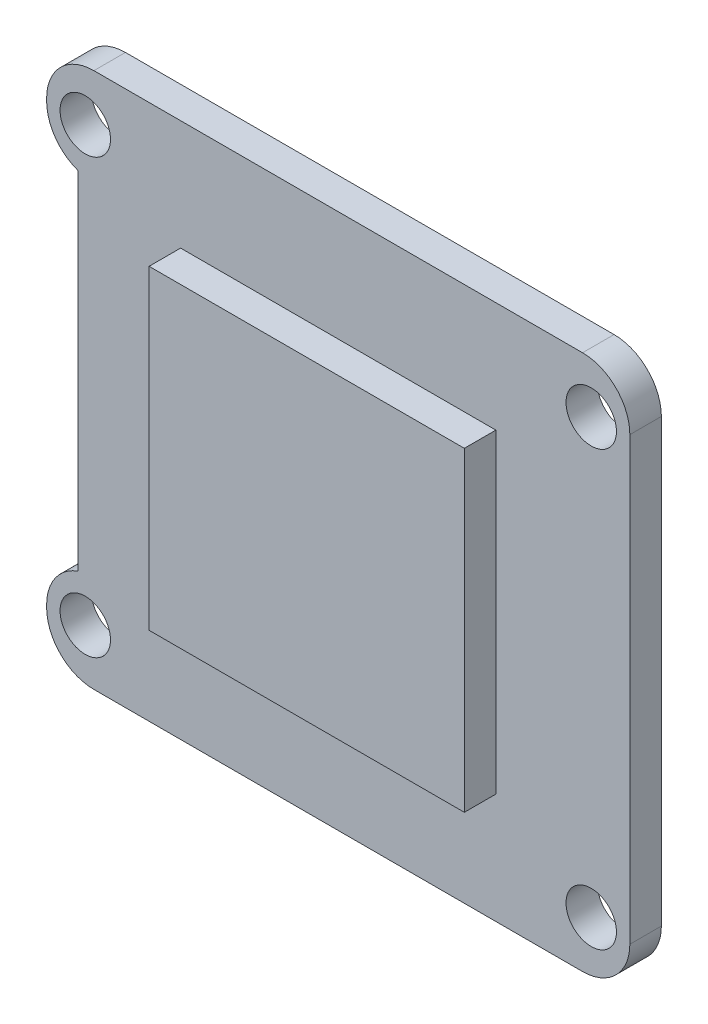
ISO-10303-21;
HEADER;
FILE_DESCRIPTION(('STEP AP214'),'2;1');
FILE_NAME('part.step','',(''),(''),'','','');
FILE_SCHEMA(('AUTOMOTIVE_DESIGN { 1 0 10303 214 1 1 1 1 }'));
ENDSEC;
DATA;
#1=APPLICATION_CONTEXT('core data for automotive mechanical design processes');
#2=APPLICATION_PROTOCOL_DEFINITION('international standard','automotive_design',2000,#1);
#3=PRODUCT_CONTEXT('',#1,'mechanical');
#4=PRODUCT('Part','Part','',(#3));
#5=PRODUCT_RELATED_PRODUCT_CATEGORY('part','',(#4));
#6=PRODUCT_DEFINITION_FORMATION('','',#4);
#7=PRODUCT_DEFINITION_CONTEXT('part definition',#1,'design');
#8=PRODUCT_DEFINITION('design','',#6,#7);
#9=PRODUCT_DEFINITION_SHAPE('','',#8);
#10=(LENGTH_UNIT() NAMED_UNIT(*) SI_UNIT(.MILLI.,.METRE.));
#11=(NAMED_UNIT(*) PLANE_ANGLE_UNIT() SI_UNIT($,.RADIAN.));
#12=(NAMED_UNIT(*) SI_UNIT($,.STERADIAN.) SOLID_ANGLE_UNIT());
#13=UNCERTAINTY_MEASURE_WITH_UNIT(LENGTH_MEASURE(1.E-05),#10,'distance_accuracy_value','');
#14=(GEOMETRIC_REPRESENTATION_CONTEXT(3) GLOBAL_UNCERTAINTY_ASSIGNED_CONTEXT((#13)) GLOBAL_UNIT_ASSIGNED_CONTEXT((#10,
#11,#12)) REPRESENTATION_CONTEXT('',''));
#15=CARTESIAN_POINT('',(0.,0.,0.));
#16=DIRECTION('',(0.,0.,1.));
#17=DIRECTION('',(1.,0.,0.));
#18=AXIS2_PLACEMENT_3D('',#15,#16,#17);
#19=CARTESIAN_POINT('',(0.,0.,2.));
#20=DIRECTION('',(1.,0.,0.));
#21=DIRECTION('',(0.,0.,-1.));
#22=AXIS2_PLACEMENT_3D('',#19,#20,#21);
#23=PLANE('',#22);
#24=DIRECTION('',(0.,-1.,0.));
#25=VECTOR('',#24,1.);
#26=CARTESIAN_POINT('',(0.,0.,0.));
#27=LINE('',#26,#25);
#28=CARTESIAN_POINT('',(0.,3.17157287525381,0.));
#29=VERTEX_POINT('',#28);
#30=CARTESIAN_POINT('',(0.,3.,0.));
#31=VERTEX_POINT('',#30);
#32=EDGE_CURVE('E228',#29,#31,#27,.T.);
#33=ORIENTED_EDGE('',*,*,#32,.T.);
#34=DIRECTION('',(0.,0.,-1.));
#35=VECTOR('',#34,1.);
#36=CARTESIAN_POINT('',(0.,3.,2.));
#37=LINE('',#36,#35);
#38=CARTESIAN_POINT('',(0.,3.,2.));
#39=VERTEX_POINT('',#38);
#40=EDGE_CURVE('E291',#31,#39,#37,.F.);
#41=ORIENTED_EDGE('',*,*,#40,.T.);
#42=DIRECTION('',(0.,-1.,0.));
#43=VECTOR('',#42,1.);
#44=CARTESIAN_POINT('',(0.,0.,2.));
#45=LINE('',#44,#43);
#46=CARTESIAN_POINT('',(0.,3.17157287525381,2.));
#47=VERTEX_POINT('',#46);
#48=EDGE_CURVE('E234',#47,#39,#45,.T.);
#49=ORIENTED_EDGE('',*,*,#48,.F.);
#50=DIRECTION('',(0.,0.,1.));
#51=VECTOR('',#50,1.);
#52=CARTESIAN_POINT('',(0.,3.17157287525381,2.));
#53=LINE('',#52,#51);
#54=EDGE_CURVE('E288',#47,#29,#53,.F.);
#55=ORIENTED_EDGE('',*,*,#54,.T.);
#56=EDGE_LOOP('',(#33,#41,#49,#55));
#57=FACE_BOUND('',#56,.T.);
#58=ADVANCED_FACE('F32',(#57),#23,.F.);
#59=CARTESIAN_POINT('',(0.,0.,2.));
#60=DIRECTION('',(0.,0.,-1.));
#61=DIRECTION('',(-1.,0.,0.));
#62=AXIS2_PLACEMENT_3D('',#59,#60,#61);
#63=PLANE('',#62);
#64=DIRECTION('',(0.,1.,0.));
#65=VECTOR('',#64,1.);
#66=CARTESIAN_POINT('',(37.,0.,2.));
#67=LINE('',#66,#65);
#68=CARTESIAN_POINT('',(37.,3.,2.));
#69=VERTEX_POINT('',#68);
#70=CARTESIAN_POINT('',(37.,31.,2.));
#71=VERTEX_POINT('',#70);
#72=EDGE_CURVE('E237',#69,#71,#67,.T.);
#73=ORIENTED_EDGE('',*,*,#72,.T.);
#74=CARTESIAN_POINT('',(34.,31.,2.));
#75=DIRECTION('',(0.,0.,-1.));
#76=DIRECTION('',(-1.,0.,0.));
#77=AXIS2_PLACEMENT_3D('',#74,#75,#76);
#78=CIRCLE('',#77,3.);
#79=CARTESIAN_POINT('',(34.,34.,2.));
#80=VERTEX_POINT('',#79);
#81=EDGE_CURVE('E281',#71,#80,#78,.F.);
#82=ORIENTED_EDGE('',*,*,#81,.T.);
#83=DIRECTION('',(-1.,0.,0.));
#84=VECTOR('',#83,1.);
#85=CARTESIAN_POINT('',(0.,34.,2.));
#86=LINE('',#85,#84);
#87=CARTESIAN_POINT('',(3.,34.,2.));
#88=VERTEX_POINT('',#87);
#89=EDGE_CURVE('E240',#80,#88,#86,.T.);
#90=ORIENTED_EDGE('',*,*,#89,.T.);
#91=CARTESIAN_POINT('',(3.,31.,2.));
#92=DIRECTION('',(0.,0.,-1.));
#93=DIRECTION('',(-1.,0.,0.));
#94=AXIS2_PLACEMENT_3D('',#91,#92,#93);
#95=CIRCLE('',#94,3.);
#96=CARTESIAN_POINT('',(0.,31.,2.));
#97=VERTEX_POINT('',#96);
#98=EDGE_CURVE('E52',#88,#97,#95,.F.);
#99=ORIENTED_EDGE('',*,*,#98,.T.);
#100=CARTESIAN_POINT('',(0.,30.8284271247462,2.));
#101=VERTEX_POINT('',#100);
#102=EDGE_CURVE('E231',#97,#101,#45,.T.);
#103=ORIENTED_EDGE('',*,*,#102,.T.);
#104=CARTESIAN_POINT('',(3.,30.8284271247462,2.));
#105=DIRECTION('',(0.,0.,-1.));
#106=DIRECTION('',(-1.,0.,0.));
#107=AXIS2_PLACEMENT_3D('',#104,#105,#106);
#108=CIRCLE('',#107,3.);
#109=CARTESIAN_POINT('',(2.,28.,2.));
#110=VERTEX_POINT('',#109);
#111=EDGE_CURVE('E273',#101,#110,#108,.F.);
#112=ORIENTED_EDGE('',*,*,#111,.T.);
#113=DIRECTION('',(0.,-1.,0.));
#114=VECTOR('',#113,1.);
#115=CARTESIAN_POINT('',(2.,0.,2.));
#116=LINE('',#115,#114);
#117=CARTESIAN_POINT('',(2.,6.,2.));
#118=VERTEX_POINT('',#117);
#119=EDGE_CURVE('E162',#110,#118,#116,.T.);
#120=ORIENTED_EDGE('',*,*,#119,.T.);
#121=CARTESIAN_POINT('',(3.,3.17157287525381,2.));
#122=DIRECTION('',(0.,0.,-1.));
#123=DIRECTION('',(-1.,0.,0.));
#124=AXIS2_PLACEMENT_3D('',#121,#122,#123);
#125=CIRCLE('',#124,3.);
#126=EDGE_CURVE('E275',#118,#47,#125,.F.);
#127=ORIENTED_EDGE('',*,*,#126,.T.);
#128=ORIENTED_EDGE('',*,*,#48,.T.);
#129=CARTESIAN_POINT('',(3.,3.,2.));
#130=DIRECTION('',(0.,0.,-1.));
#131=DIRECTION('',(-1.,0.,0.));
#132=AXIS2_PLACEMENT_3D('',#129,#130,#131);
#133=CIRCLE('',#132,3.);
#134=CARTESIAN_POINT('',(3.,0.,2.));
#135=VERTEX_POINT('',#134);
#136=EDGE_CURVE('E277',#39,#135,#133,.F.);
#137=ORIENTED_EDGE('',*,*,#136,.T.);
#138=DIRECTION('',(1.,0.,0.));
#139=VECTOR('',#138,1.);
#140=CARTESIAN_POINT('',(0.,0.,2.));
#141=LINE('',#140,#139);
#142=CARTESIAN_POINT('',(34.,0.,2.));
#143=VERTEX_POINT('',#142);
#144=EDGE_CURVE('E233',#135,#143,#141,.T.);
#145=ORIENTED_EDGE('',*,*,#144,.T.);
#146=CARTESIAN_POINT('',(34.,3.,2.));
#147=DIRECTION('',(0.,0.,-1.));
#148=DIRECTION('',(-1.,0.,0.));
#149=AXIS2_PLACEMENT_3D('',#146,#147,#148);
#150=CIRCLE('',#149,3.);
#151=EDGE_CURVE('E279',#143,#69,#150,.F.);
#152=ORIENTED_EDGE('',*,*,#151,.T.);
#153=EDGE_LOOP('',(#73,#82,#90,#99,#103,#112,#120,#127,#128,#137,#145,#152));
#154=FACE_BOUND('',#153,.T.);
#155=CARTESIAN_POINT('',(34.55,30.75,2.));
#156=DIRECTION('',(0.,0.,1.));
#157=DIRECTION('',(1.,0.,0.));
#158=AXIS2_PLACEMENT_3D('',#155,#156,#157);
#159=CIRCLE('',#158,1.6);
#160=CARTESIAN_POINT('',(36.15,30.75,2.));
#161=VERTEX_POINT('',#160);
#162=EDGE_CURVE('E216',#161,#161,#159,.T.);
#163=ORIENTED_EDGE('',*,*,#162,.F.);
#164=EDGE_LOOP('',(#163));
#165=FACE_BOUND('',#164,.T.);
#166=CARTESIAN_POINT('',(2.45,3.25000000000001,2.));
#167=DIRECTION('',(0.,0.,1.));
#168=DIRECTION('',(1.,0.,0.));
#169=AXIS2_PLACEMENT_3D('',#166,#167,#168);
#170=CIRCLE('',#169,1.6);
#171=CARTESIAN_POINT('',(4.05,3.25000000000001,2.));
#172=VERTEX_POINT('',#171);
#173=EDGE_CURVE('E207',#172,#172,#170,.T.);
#174=ORIENTED_EDGE('',*,*,#173,.F.);
#175=EDGE_LOOP('',(#174));
#176=FACE_BOUND('',#175,.T.);
#177=CARTESIAN_POINT('',(2.45,30.75,2.));
#178=DIRECTION('',(0.,0.,1.));
#179=DIRECTION('',(1.,0.,0.));
#180=AXIS2_PLACEMENT_3D('',#177,#178,#179);
#181=CIRCLE('',#180,1.6);
#182=CARTESIAN_POINT('',(4.05,30.75,2.));
#183=VERTEX_POINT('',#182);
#184=EDGE_CURVE('E220',#183,#183,#181,.T.);
#185=ORIENTED_EDGE('',*,*,#184,.F.);
#186=EDGE_LOOP('',(#185));
#187=FACE_BOUND('',#186,.T.);
#188=CARTESIAN_POINT('',(34.55,3.25000000000001,2.));
#189=DIRECTION('',(0.,0.,1.));
#190=DIRECTION('',(1.,0.,0.));
#191=AXIS2_PLACEMENT_3D('',#188,#189,#190);
#192=CIRCLE('',#191,1.6);
#193=CARTESIAN_POINT('',(36.15,3.25000000000001,2.));
#194=VERTEX_POINT('',#193);
#195=EDGE_CURVE('E213',#194,#194,#192,.T.);
#196=ORIENTED_EDGE('',*,*,#195,.F.);
#197=EDGE_LOOP('',(#196));
#198=FACE_BOUND('',#197,.T.);
#199=DIRECTION('',(0.,1.,0.));
#200=VECTOR('',#199,1.);
#201=CARTESIAN_POINT('',(28.5,7.00000000000001,2.));
#202=LINE('',#201,#200);
#203=CARTESIAN_POINT('',(28.5,7.00000000000001,2.));
#204=VERTEX_POINT('',#203);
#205=CARTESIAN_POINT('',(28.5,27.,2.));
#206=VERTEX_POINT('',#205);
#207=EDGE_CURVE('E173',#204,#206,#202,.T.);
#208=ORIENTED_EDGE('',*,*,#207,.F.);
#209=DIRECTION('',(1.,0.,0.));
#210=VECTOR('',#209,1.);
#211=CARTESIAN_POINT('',(8.5,7.00000000000001,2.));
#212=LINE('',#211,#210);
#213=CARTESIAN_POINT('',(8.5,7.00000000000001,2.));
#214=VERTEX_POINT('',#213);
#215=EDGE_CURVE('E178',#214,#204,#212,.T.);
#216=ORIENTED_EDGE('',*,*,#215,.F.);
#217=DIRECTION('',(0.,-1.,0.));
#218=VECTOR('',#217,1.);
#219=CARTESIAN_POINT('',(8.5,7.00000000000001,2.));
#220=LINE('',#219,#218);
#221=CARTESIAN_POINT('',(8.5,27.,2.));
#222=VERTEX_POINT('',#221);
#223=EDGE_CURVE('E190',#222,#214,#220,.T.);
#224=ORIENTED_EDGE('',*,*,#223,.F.);
#225=DIRECTION('',(-1.,0.,0.));
#226=VECTOR('',#225,1.);
#227=CARTESIAN_POINT('',(8.5,27.,2.));
#228=LINE('',#227,#226);
#229=EDGE_CURVE('E187',#206,#222,#228,.T.);
#230=ORIENTED_EDGE('',*,*,#229,.F.);
#231=EDGE_LOOP('',(#208,#216,#224,#230));
#232=FACE_BOUND('',#231,.T.);
#233=ADVANCED_FACE('F307',(#154,#165,#176,#187,#198,#232),#63,.F.);
#234=CARTESIAN_POINT('',(0.,31.,0.));
#235=VERTEX_POINT('',#234);
#236=CARTESIAN_POINT('',(0.,30.8284271247462,0.));
#237=VERTEX_POINT('',#236);
#238=EDGE_CURVE('E245',#235,#237,#27,.T.);
#239=ORIENTED_EDGE('',*,*,#238,.T.);
#240=DIRECTION('',(0.,0.,-1.));
#241=VECTOR('',#240,1.);
#242=CARTESIAN_POINT('',(0.,30.8284271247462,2.));
#243=LINE('',#242,#241);
#244=EDGE_CURVE('E11',#237,#101,#243,.F.);
#245=ORIENTED_EDGE('',*,*,#244,.T.);
#246=ORIENTED_EDGE('',*,*,#102,.F.);
#247=DIRECTION('',(0.,0.,-1.));
#248=VECTOR('',#247,1.);
#249=CARTESIAN_POINT('',(0.,31.,2.));
#250=LINE('',#249,#248);
#251=EDGE_CURVE('E40',#97,#235,#250,.T.);
#252=ORIENTED_EDGE('',*,*,#251,.T.);
#253=EDGE_LOOP('',(#239,#245,#246,#252));
#254=FACE_BOUND('',#253,.T.);
#255=ADVANCED_FACE('F294',(#254),#23,.F.);
#256=CARTESIAN_POINT('',(0.,0.,2.));
#257=DIRECTION('',(0.,1.,0.));
#258=DIRECTION('',(0.,0.,1.));
#259=AXIS2_PLACEMENT_3D('',#256,#257,#258);
#260=PLANE('',#259);
#261=DIRECTION('',(1.,0.,0.));
#262=VECTOR('',#261,1.);
#263=CARTESIAN_POINT('',(0.,0.,0.));
#264=LINE('',#263,#262);
#265=CARTESIAN_POINT('',(3.,0.,0.));
#266=VERTEX_POINT('',#265);
#267=CARTESIAN_POINT('',(34.,0.,0.));
#268=VERTEX_POINT('',#267);
#269=EDGE_CURVE('E246',#266,#268,#264,.T.);
#270=ORIENTED_EDGE('',*,*,#269,.T.);
#271=DIRECTION('',(0.,0.,-1.));
#272=VECTOR('',#271,1.);
#273=CARTESIAN_POINT('',(34.,0.,2.));
#274=LINE('',#273,#272);
#275=EDGE_CURVE('E286',#268,#143,#274,.F.);
#276=ORIENTED_EDGE('',*,*,#275,.T.);
#277=ORIENTED_EDGE('',*,*,#144,.F.);
#278=DIRECTION('',(0.,0.,-1.));
#279=VECTOR('',#278,1.);
#280=CARTESIAN_POINT('',(3.,0.,2.));
#281=LINE('',#280,#279);
#282=EDGE_CURVE('E283',#135,#266,#281,.T.);
#283=ORIENTED_EDGE('',*,*,#282,.T.);
#284=EDGE_LOOP('',(#270,#276,#277,#283));
#285=FACE_BOUND('',#284,.T.);
#286=ADVANCED_FACE('F317',(#285),#260,.F.);
#287=CARTESIAN_POINT('',(37.,0.,2.));
#288=DIRECTION('',(-1.,0.,0.));
#289=DIRECTION('',(0.,0.,1.));
#290=AXIS2_PLACEMENT_3D('',#287,#288,#289);
#291=PLANE('',#290);
#292=DIRECTION('',(0.,1.,0.));
#293=VECTOR('',#292,1.);
#294=CARTESIAN_POINT('',(37.,0.,0.));
#295=LINE('',#294,#293);
#296=CARTESIAN_POINT('',(37.,3.,0.));
#297=VERTEX_POINT('',#296);
#298=CARTESIAN_POINT('',(37.,31.,0.));
#299=VERTEX_POINT('',#298);
#300=EDGE_CURVE('E249',#297,#299,#295,.T.);
#301=ORIENTED_EDGE('',*,*,#300,.T.);
#302=DIRECTION('',(0.,0.,-1.));
#303=VECTOR('',#302,1.);
#304=CARTESIAN_POINT('',(37.,31.,2.));
#305=LINE('',#304,#303);
#306=EDGE_CURVE('E270',#299,#71,#305,.F.);
#307=ORIENTED_EDGE('',*,*,#306,.T.);
#308=ORIENTED_EDGE('',*,*,#72,.F.);
#309=DIRECTION('',(0.,0.,-1.));
#310=VECTOR('',#309,1.);
#311=CARTESIAN_POINT('',(37.,3.,2.));
#312=LINE('',#311,#310);
#313=EDGE_CURVE('E267',#69,#297,#312,.T.);
#314=ORIENTED_EDGE('',*,*,#313,.T.);
#315=EDGE_LOOP('',(#301,#307,#308,#314));
#316=FACE_BOUND('',#315,.T.);
#317=ADVANCED_FACE('F321',(#316),#291,.F.);
#318=CARTESIAN_POINT('',(0.,34.,2.));
#319=DIRECTION('',(0.,-1.,0.));
#320=DIRECTION('',(0.,0.,-1.));
#321=AXIS2_PLACEMENT_3D('',#318,#319,#320);
#322=PLANE('',#321);
#323=ORIENTED_EDGE('',*,*,#89,.F.);
#324=DIRECTION('',(0.,0.,-1.));
#325=VECTOR('',#324,1.);
#326=CARTESIAN_POINT('',(34.,34.,2.));
#327=LINE('',#326,#325);
#328=CARTESIAN_POINT('',(34.,34.,0.));
#329=VERTEX_POINT('',#328);
#330=EDGE_CURVE('E256',#80,#329,#327,.T.);
#331=ORIENTED_EDGE('',*,*,#330,.T.);
#332=DIRECTION('',(-1.,0.,0.));
#333=VECTOR('',#332,1.);
#334=CARTESIAN_POINT('',(0.,34.,0.));
#335=LINE('',#334,#333);
#336=CARTESIAN_POINT('',(3.,34.,0.));
#337=VERTEX_POINT('',#336);
#338=EDGE_CURVE('E252',#329,#337,#335,.T.);
#339=ORIENTED_EDGE('',*,*,#338,.T.);
#340=DIRECTION('',(0.,0.,-1.));
#341=VECTOR('',#340,1.);
#342=CARTESIAN_POINT('',(3.,34.,2.));
#343=LINE('',#342,#341);
#344=EDGE_CURVE('E242',#337,#88,#343,.F.);
#345=ORIENTED_EDGE('',*,*,#344,.T.);
#346=EDGE_LOOP('',(#323,#331,#339,#345));
#347=FACE_BOUND('',#346,.T.);
#348=ADVANCED_FACE('F299',(#347),#322,.F.);
#349=CARTESIAN_POINT('',(0.,0.,0.));
#350=DIRECTION('',(0.,0.,-1.));
#351=DIRECTION('',(-1.,0.,0.));
#352=AXIS2_PLACEMENT_3D('',#349,#350,#351);
#353=PLANE('',#352);
#354=ORIENTED_EDGE('',*,*,#338,.F.);
#355=CARTESIAN_POINT('',(34.,31.,0.));
#356=DIRECTION('',(0.,0.,-1.));
#357=DIRECTION('',(-1.,0.,0.));
#358=AXIS2_PLACEMENT_3D('',#355,#356,#357);
#359=CIRCLE('',#358,3.);
#360=EDGE_CURVE('E265',#329,#299,#359,.T.);
#361=ORIENTED_EDGE('',*,*,#360,.T.);
#362=ORIENTED_EDGE('',*,*,#300,.F.);
#363=CARTESIAN_POINT('',(34.,3.,0.));
#364=DIRECTION('',(0.,0.,-1.));
#365=DIRECTION('',(-1.,0.,0.));
#366=AXIS2_PLACEMENT_3D('',#363,#364,#365);
#367=CIRCLE('',#366,3.);
#368=EDGE_CURVE('E263',#297,#268,#367,.T.);
#369=ORIENTED_EDGE('',*,*,#368,.T.);
#370=ORIENTED_EDGE('',*,*,#269,.F.);
#371=CARTESIAN_POINT('',(3.,3.,0.));
#372=DIRECTION('',(0.,0.,-1.));
#373=DIRECTION('',(-1.,0.,0.));
#374=AXIS2_PLACEMENT_3D('',#371,#372,#373);
#375=CIRCLE('',#374,3.);
#376=EDGE_CURVE('E261',#266,#31,#375,.T.);
#377=ORIENTED_EDGE('',*,*,#376,.T.);
#378=ORIENTED_EDGE('',*,*,#32,.F.);
#379=CARTESIAN_POINT('',(3.,3.17157287525381,0.));
#380=DIRECTION('',(0.,0.,-1.));
#381=DIRECTION('',(-1.,0.,0.));
#382=AXIS2_PLACEMENT_3D('',#379,#380,#381);
#383=CIRCLE('',#382,3.);
#384=CARTESIAN_POINT('',(2.,6.,0.));
#385=VERTEX_POINT('',#384);
#386=EDGE_CURVE('E152',#29,#385,#383,.T.);
#387=ORIENTED_EDGE('',*,*,#386,.T.);
#388=DIRECTION('',(0.,-1.,0.));
#389=VECTOR('',#388,1.);
#390=CARTESIAN_POINT('',(2.,28.,0.));
#391=LINE('',#390,#389);
#392=CARTESIAN_POINT('',(2.,28.,0.));
#393=VERTEX_POINT('',#392);
#394=EDGE_CURVE('E159',#393,#385,#391,.T.);
#395=ORIENTED_EDGE('',*,*,#394,.F.);
#396=CARTESIAN_POINT('',(3.,30.8284271247462,0.));
#397=DIRECTION('',(0.,0.,-1.));
#398=DIRECTION('',(-1.,0.,0.));
#399=AXIS2_PLACEMENT_3D('',#396,#397,#398);
#400=CIRCLE('',#399,3.);
#401=EDGE_CURVE('E144',#393,#237,#400,.T.);
#402=ORIENTED_EDGE('',*,*,#401,.T.);
#403=ORIENTED_EDGE('',*,*,#238,.F.);
#404=CARTESIAN_POINT('',(3.,31.,0.));
#405=DIRECTION('',(0.,0.,-1.));
#406=DIRECTION('',(-1.,0.,0.));
#407=AXIS2_PLACEMENT_3D('',#404,#405,#406);
#408=CIRCLE('',#407,3.);
#409=EDGE_CURVE('E153',#235,#337,#408,.T.);
#410=ORIENTED_EDGE('',*,*,#409,.T.);
#411=EDGE_LOOP('',(#354,#361,#362,#369,#370,#377,#378,#387,#395,#402,#403,#410));
#412=FACE_BOUND('',#411,.T.);
#413=CARTESIAN_POINT('',(34.55,3.25000000000001,0.));
#414=DIRECTION('',(0.,0.,1.));
#415=DIRECTION('',(1.,0.,0.));
#416=AXIS2_PLACEMENT_3D('',#413,#414,#415);
#417=CIRCLE('',#416,1.6);
#418=CARTESIAN_POINT('',(36.15,3.25000000000001,0.));
#419=VERTEX_POINT('',#418);
#420=EDGE_CURVE('E217',#419,#419,#417,.T.);
#421=ORIENTED_EDGE('',*,*,#420,.T.);
#422=EDGE_LOOP('',(#421));
#423=FACE_BOUND('',#422,.T.);
#424=CARTESIAN_POINT('',(2.45,30.75,0.));
#425=DIRECTION('',(0.,0.,1.));
#426=DIRECTION('',(1.,0.,0.));
#427=AXIS2_PLACEMENT_3D('',#424,#425,#426);
#428=CIRCLE('',#427,1.6);
#429=CARTESIAN_POINT('',(4.05,30.75,0.));
#430=VERTEX_POINT('',#429);
#431=EDGE_CURVE('E210',#430,#430,#428,.T.);
#432=ORIENTED_EDGE('',*,*,#431,.T.);
#433=EDGE_LOOP('',(#432));
#434=FACE_BOUND('',#433,.T.);
#435=CARTESIAN_POINT('',(2.45,3.25000000000001,0.));
#436=DIRECTION('',(0.,0.,1.));
#437=DIRECTION('',(1.,0.,0.));
#438=AXIS2_PLACEMENT_3D('',#435,#436,#437);
#439=CIRCLE('',#438,1.6);
#440=CARTESIAN_POINT('',(4.05,3.25000000000001,0.));
#441=VERTEX_POINT('',#440);
#442=EDGE_CURVE('E206',#441,#441,#439,.T.);
#443=ORIENTED_EDGE('',*,*,#442,.T.);
#444=EDGE_LOOP('',(#443));
#445=FACE_BOUND('',#444,.T.);
#446=CARTESIAN_POINT('',(34.55,30.75,0.));
#447=DIRECTION('',(0.,0.,1.));
#448=DIRECTION('',(1.,0.,0.));
#449=AXIS2_PLACEMENT_3D('',#446,#447,#448);
#450=CIRCLE('',#449,1.6);
#451=CARTESIAN_POINT('',(36.15,30.75,0.));
#452=VERTEX_POINT('',#451);
#453=EDGE_CURVE('E225',#452,#452,#450,.T.);
#454=ORIENTED_EDGE('',*,*,#453,.T.);
#455=EDGE_LOOP('',(#454));
#456=FACE_BOUND('',#455,.T.);
#457=ADVANCED_FACE('F166',(#412,#423,#434,#445,#456),#353,.T.);
#458=CARTESIAN_POINT('',(34.55,30.75,0.));
#459=DIRECTION('',(0.,0.,1.));
#460=DIRECTION('',(1.,0.,0.));
#461=AXIS2_PLACEMENT_3D('',#458,#459,#460);
#462=CYLINDRICAL_SURFACE('',#461,1.6);
#463=ORIENTED_EDGE('',*,*,#453,.F.);
#464=EDGE_LOOP('',(#463));
#465=FACE_BOUND('',#464,.T.);
#466=ORIENTED_EDGE('',*,*,#162,.T.);
#467=EDGE_LOOP('',(#466));
#468=FACE_BOUND('',#467,.T.);
#469=ADVANCED_FACE('F332',(#465,#468),#462,.F.);
#470=CARTESIAN_POINT('',(2.45,3.25000000000001,0.));
#471=DIRECTION('',(0.,0.,1.));
#472=DIRECTION('',(1.,0.,0.));
#473=AXIS2_PLACEMENT_3D('',#470,#471,#472);
#474=CYLINDRICAL_SURFACE('',#473,1.6);
#475=ORIENTED_EDGE('',*,*,#442,.F.);
#476=EDGE_LOOP('',(#475));
#477=FACE_BOUND('',#476,.T.);
#478=ORIENTED_EDGE('',*,*,#173,.T.);
#479=EDGE_LOOP('',(#478));
#480=FACE_BOUND('',#479,.T.);
#481=ADVANCED_FACE('F336',(#477,#480),#474,.F.);
#482=CARTESIAN_POINT('',(2.45,30.75,0.));
#483=DIRECTION('',(0.,0.,1.));
#484=DIRECTION('',(1.,0.,0.));
#485=AXIS2_PLACEMENT_3D('',#482,#483,#484);
#486=CYLINDRICAL_SURFACE('',#485,1.6);
#487=ORIENTED_EDGE('',*,*,#431,.F.);
#488=EDGE_LOOP('',(#487));
#489=FACE_BOUND('',#488,.T.);
#490=ORIENTED_EDGE('',*,*,#184,.T.);
#491=EDGE_LOOP('',(#490));
#492=FACE_BOUND('',#491,.T.);
#493=ADVANCED_FACE('F338',(#489,#492),#486,.F.);
#494=CARTESIAN_POINT('',(34.55,3.25000000000001,0.));
#495=DIRECTION('',(0.,0.,1.));
#496=DIRECTION('',(1.,0.,0.));
#497=AXIS2_PLACEMENT_3D('',#494,#495,#496);
#498=CYLINDRICAL_SURFACE('',#497,1.6);
#499=ORIENTED_EDGE('',*,*,#420,.F.);
#500=EDGE_LOOP('',(#499));
#501=FACE_BOUND('',#500,.T.);
#502=ORIENTED_EDGE('',*,*,#195,.T.);
#503=EDGE_LOOP('',(#502));
#504=FACE_BOUND('',#503,.T.);
#505=ADVANCED_FACE('F341',(#501,#504),#498,.F.);
#506=CARTESIAN_POINT('',(28.5,7.00000000000001,4.));
#507=DIRECTION('',(-1.,0.,0.));
#508=DIRECTION('',(0.,0.,1.));
#509=AXIS2_PLACEMENT_3D('',#506,#507,#508);
#510=PLANE('',#509);
#511=ORIENTED_EDGE('',*,*,#207,.T.);
#512=DIRECTION('',(0.,0.,-1.));
#513=VECTOR('',#512,1.);
#514=CARTESIAN_POINT('',(28.5,27.,4.));
#515=LINE('',#514,#513);
#516=CARTESIAN_POINT('',(28.5,27.,4.));
#517=VERTEX_POINT('',#516);
#518=EDGE_CURVE('E203',#517,#206,#515,.T.);
#519=ORIENTED_EDGE('',*,*,#518,.F.);
#520=DIRECTION('',(0.,1.,0.));
#521=VECTOR('',#520,1.);
#522=CARTESIAN_POINT('',(28.5,7.00000000000001,4.));
#523=LINE('',#522,#521);
#524=CARTESIAN_POINT('',(28.5,7.00000000000001,4.));
#525=VERTEX_POINT('',#524);
#526=EDGE_CURVE('E174',#525,#517,#523,.T.);
#527=ORIENTED_EDGE('',*,*,#526,.F.);
#528=DIRECTION('',(0.,0.,-1.));
#529=VECTOR('',#528,1.);
#530=CARTESIAN_POINT('',(28.5,7.00000000000001,4.));
#531=LINE('',#530,#529);
#532=EDGE_CURVE('E184',#525,#204,#531,.T.);
#533=ORIENTED_EDGE('',*,*,#532,.T.);
#534=EDGE_LOOP('',(#511,#519,#527,#533));
#535=FACE_BOUND('',#534,.T.);
#536=ADVANCED_FACE('F345',(#535),#510,.F.);
#537=CARTESIAN_POINT('',(8.5,27.,4.));
#538=DIRECTION('',(0.,-1.,0.));
#539=DIRECTION('',(0.,0.,-1.));
#540=AXIS2_PLACEMENT_3D('',#537,#538,#539);
#541=PLANE('',#540);
#542=ORIENTED_EDGE('',*,*,#229,.T.);
#543=DIRECTION('',(0.,0.,-1.));
#544=VECTOR('',#543,1.);
#545=CARTESIAN_POINT('',(8.5,27.,4.));
#546=LINE('',#545,#544);
#547=CARTESIAN_POINT('',(8.5,27.,4.));
#548=VERTEX_POINT('',#547);
#549=EDGE_CURVE('E200',#548,#222,#546,.T.);
#550=ORIENTED_EDGE('',*,*,#549,.F.);
#551=DIRECTION('',(-1.,0.,0.));
#552=VECTOR('',#551,1.);
#553=CARTESIAN_POINT('',(8.5,27.,4.));
#554=LINE('',#553,#552);
#555=EDGE_CURVE('E177',#517,#548,#554,.T.);
#556=ORIENTED_EDGE('',*,*,#555,.F.);
#557=ORIENTED_EDGE('',*,*,#518,.T.);
#558=EDGE_LOOP('',(#542,#550,#556,#557));
#559=FACE_BOUND('',#558,.T.);
#560=ADVANCED_FACE('F352',(#559),#541,.F.);
#561=CARTESIAN_POINT('',(8.5,7.00000000000001,4.));
#562=DIRECTION('',(1.,0.,0.));
#563=DIRECTION('',(0.,0.,-1.));
#564=AXIS2_PLACEMENT_3D('',#561,#562,#563);
#565=PLANE('',#564);
#566=ORIENTED_EDGE('',*,*,#223,.T.);
#567=DIRECTION('',(0.,0.,-1.));
#568=VECTOR('',#567,1.);
#569=CARTESIAN_POINT('',(8.5,7.00000000000001,4.));
#570=LINE('',#569,#568);
#571=CARTESIAN_POINT('',(8.5,7.00000000000001,4.));
#572=VERTEX_POINT('',#571);
#573=EDGE_CURVE('E197',#572,#214,#570,.T.);
#574=ORIENTED_EDGE('',*,*,#573,.F.);
#575=DIRECTION('',(0.,-1.,0.));
#576=VECTOR('',#575,1.);
#577=CARTESIAN_POINT('',(8.5,7.00000000000001,4.));
#578=LINE('',#577,#576);
#579=EDGE_CURVE('E180',#548,#572,#578,.T.);
#580=ORIENTED_EDGE('',*,*,#579,.F.);
#581=ORIENTED_EDGE('',*,*,#549,.T.);
#582=EDGE_LOOP('',(#566,#574,#580,#581));
#583=FACE_BOUND('',#582,.T.);
#584=ADVANCED_FACE('F356',(#583),#565,.F.);
#585=CARTESIAN_POINT('',(8.5,7.00000000000001,4.));
#586=DIRECTION('',(0.,1.,0.));
#587=DIRECTION('',(0.,0.,1.));
#588=AXIS2_PLACEMENT_3D('',#585,#586,#587);
#589=PLANE('',#588);
#590=ORIENTED_EDGE('',*,*,#215,.T.);
#591=ORIENTED_EDGE('',*,*,#532,.F.);
#592=DIRECTION('',(1.,0.,0.));
#593=VECTOR('',#592,1.);
#594=CARTESIAN_POINT('',(8.5,7.00000000000001,4.));
#595=LINE('',#594,#593);
#596=EDGE_CURVE('E182',#572,#525,#595,.T.);
#597=ORIENTED_EDGE('',*,*,#596,.F.);
#598=ORIENTED_EDGE('',*,*,#573,.T.);
#599=EDGE_LOOP('',(#590,#591,#597,#598));
#600=FACE_BOUND('',#599,.T.);
#601=ADVANCED_FACE('F360',(#600),#589,.F.);
#602=CARTESIAN_POINT('',(0.,0.,4.));
#603=DIRECTION('',(0.,0.,-1.));
#604=DIRECTION('',(-1.,0.,0.));
#605=AXIS2_PLACEMENT_3D('',#602,#603,#604);
#606=PLANE('',#605);
#607=ORIENTED_EDGE('',*,*,#526,.T.);
#608=ORIENTED_EDGE('',*,*,#555,.T.);
#609=ORIENTED_EDGE('',*,*,#579,.T.);
#610=ORIENTED_EDGE('',*,*,#596,.T.);
#611=EDGE_LOOP('',(#607,#608,#609,#610));
#612=FACE_BOUND('',#611,.T.);
#613=ADVANCED_FACE('F364',(#612),#606,.F.);
#614=CARTESIAN_POINT('',(2.,28.,4.));
#615=DIRECTION('',(1.,0.,0.));
#616=DIRECTION('',(0.,1.,0.));
#617=AXIS2_PLACEMENT_3D('',#614,#615,#616);
#618=PLANE('',#617);
#619=DIRECTION('',(0.,0.,-1.));
#620=VECTOR('',#619,1.);
#621=CARTESIAN_POINT('',(2.,28.,4.));
#622=LINE('',#621,#620);
#623=EDGE_CURVE('E148',#110,#393,#622,.T.);
#624=ORIENTED_EDGE('',*,*,#623,.T.);
#625=ORIENTED_EDGE('',*,*,#394,.T.);
#626=DIRECTION('',(0.,0.,-1.));
#627=VECTOR('',#626,1.);
#628=CARTESIAN_POINT('',(2.,6.,4.));
#629=LINE('',#628,#627);
#630=EDGE_CURVE('E163',#118,#385,#629,.T.);
#631=ORIENTED_EDGE('',*,*,#630,.F.);
#632=ORIENTED_EDGE('',*,*,#119,.F.);
#633=EDGE_LOOP('',(#624,#625,#631,#632));
#634=FACE_BOUND('',#633,.T.);
#635=ADVANCED_FACE('F158',(#634),#618,.F.);
#636=CARTESIAN_POINT('',(34.,31.,2.));
#637=DIRECTION('',(0.,0.,-1.));
#638=DIRECTION('',(-1.,0.,0.));
#639=AXIS2_PLACEMENT_3D('',#636,#637,#638);
#640=CYLINDRICAL_SURFACE('',#639,3.);
#641=ORIENTED_EDGE('',*,*,#81,.F.);
#642=ORIENTED_EDGE('',*,*,#306,.F.);
#643=ORIENTED_EDGE('',*,*,#360,.F.);
#644=ORIENTED_EDGE('',*,*,#330,.F.);
#645=EDGE_LOOP('',(#641,#642,#643,#644));
#646=FACE_BOUND('',#645,.T.);
#647=ADVANCED_FACE('F370',(#646),#640,.T.);
#648=CARTESIAN_POINT('',(34.,3.,2.));
#649=DIRECTION('',(0.,0.,-1.));
#650=DIRECTION('',(-1.,0.,0.));
#651=AXIS2_PLACEMENT_3D('',#648,#649,#650);
#652=CYLINDRICAL_SURFACE('',#651,3.);
#653=ORIENTED_EDGE('',*,*,#151,.F.);
#654=ORIENTED_EDGE('',*,*,#275,.F.);
#655=ORIENTED_EDGE('',*,*,#368,.F.);
#656=ORIENTED_EDGE('',*,*,#313,.F.);
#657=EDGE_LOOP('',(#653,#654,#655,#656));
#658=FACE_BOUND('',#657,.T.);
#659=ADVANCED_FACE('F374',(#658),#652,.T.);
#660=CARTESIAN_POINT('',(3.,3.,2.));
#661=DIRECTION('',(0.,0.,-1.));
#662=DIRECTION('',(-1.,0.,0.));
#663=AXIS2_PLACEMENT_3D('',#660,#661,#662);
#664=CYLINDRICAL_SURFACE('',#663,3.);
#665=ORIENTED_EDGE('',*,*,#136,.F.);
#666=ORIENTED_EDGE('',*,*,#40,.F.);
#667=ORIENTED_EDGE('',*,*,#376,.F.);
#668=ORIENTED_EDGE('',*,*,#282,.F.);
#669=EDGE_LOOP('',(#665,#666,#667,#668));
#670=FACE_BOUND('',#669,.T.);
#671=ADVANCED_FACE('F379',(#670),#664,.T.);
#672=CARTESIAN_POINT('',(3.,3.17157287525381,4.));
#673=DIRECTION('',(0.,0.,1.));
#674=DIRECTION('',(1.,0.,0.));
#675=AXIS2_PLACEMENT_3D('',#672,#673,#674);
#676=CYLINDRICAL_SURFACE('',#675,3.);
#677=ORIENTED_EDGE('',*,*,#126,.F.);
#678=ORIENTED_EDGE('',*,*,#630,.T.);
#679=ORIENTED_EDGE('',*,*,#386,.F.);
#680=ORIENTED_EDGE('',*,*,#54,.F.);
#681=EDGE_LOOP('',(#677,#678,#679,#680));
#682=FACE_BOUND('',#681,.T.);
#683=ADVANCED_FACE('F305',(#682),#676,.T.);
#684=CARTESIAN_POINT('',(3.,30.8284271247462,4.));
#685=DIRECTION('',(0.,0.,-1.));
#686=DIRECTION('',(-1.,0.,0.));
#687=AXIS2_PLACEMENT_3D('',#684,#685,#686);
#688=CYLINDRICAL_SURFACE('',#687,3.);
#689=ORIENTED_EDGE('',*,*,#111,.F.);
#690=ORIENTED_EDGE('',*,*,#244,.F.);
#691=ORIENTED_EDGE('',*,*,#401,.F.);
#692=ORIENTED_EDGE('',*,*,#623,.F.);
#693=EDGE_LOOP('',(#689,#690,#691,#692));
#694=FACE_BOUND('',#693,.T.);
#695=ADVANCED_FACE('F147',(#694),#688,.T.);
#696=CARTESIAN_POINT('',(3.,31.,2.));
#697=DIRECTION('',(0.,0.,-1.));
#698=DIRECTION('',(-1.,0.,0.));
#699=AXIS2_PLACEMENT_3D('',#696,#697,#698);
#700=CYLINDRICAL_SURFACE('',#699,3.);
#701=ORIENTED_EDGE('',*,*,#98,.F.);
#702=ORIENTED_EDGE('',*,*,#344,.F.);
#703=ORIENTED_EDGE('',*,*,#409,.F.);
#704=ORIENTED_EDGE('',*,*,#251,.F.);
#705=EDGE_LOOP('',(#701,#702,#703,#704));
#706=FACE_BOUND('',#705,.T.);
#707=ADVANCED_FACE('F34',(#706),#700,.T.);
#708=CLOSED_SHELL('',(#58,#233,#255,#286,#317,#348,#457,#469,#481,#493,#505,#536,#560,#584,#601,
#613,#635,#647,#659,#671,#683,#695,#707));
#709=MANIFOLD_SOLID_BREP('B2',#708);
#710=ADVANCED_BREP_SHAPE_REPRESENTATION('',(#18,#709),#14);
#711=SHAPE_DEFINITION_REPRESENTATION(#9,#710);
ENDSEC;
END-ISO-10303-21;
